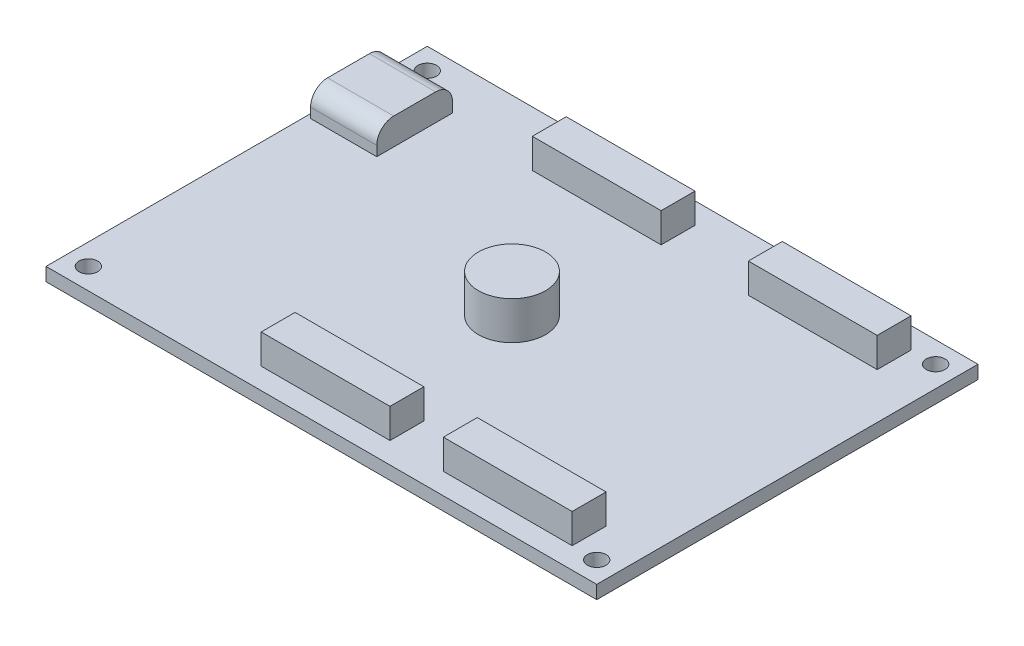
ISO-10303-21;
HEADER;
FILE_DESCRIPTION(('STEP AP214'),'2;1');
FILE_NAME('part.step','',(''),(''),'','','');
FILE_SCHEMA(('AUTOMOTIVE_DESIGN { 1 0 10303 214 1 1 1 1 }'));
ENDSEC;
DATA;
#1=APPLICATION_CONTEXT('core data for automotive mechanical design processes');
#2=APPLICATION_PROTOCOL_DEFINITION('international standard','automotive_design',2000,#1);
#3=PRODUCT_CONTEXT('',#1,'mechanical');
#4=PRODUCT('Part','Part','',(#3));
#5=PRODUCT_RELATED_PRODUCT_CATEGORY('part','',(#4));
#6=PRODUCT_DEFINITION_FORMATION('','',#4);
#7=PRODUCT_DEFINITION_CONTEXT('part definition',#1,'design');
#8=PRODUCT_DEFINITION('design','',#6,#7);
#9=PRODUCT_DEFINITION_SHAPE('','',#8);
#10=(LENGTH_UNIT() NAMED_UNIT(*) SI_UNIT(.MILLI.,.METRE.));
#11=(NAMED_UNIT(*) PLANE_ANGLE_UNIT() SI_UNIT($,.RADIAN.));
#12=(NAMED_UNIT(*) SI_UNIT($,.STERADIAN.) SOLID_ANGLE_UNIT());
#13=UNCERTAINTY_MEASURE_WITH_UNIT(LENGTH_MEASURE(1.E-05),#10,'distance_accuracy_value','');
#14=(GEOMETRIC_REPRESENTATION_CONTEXT(3) GLOBAL_UNCERTAINTY_ASSIGNED_CONTEXT((#13)) GLOBAL_UNIT_ASSIGNED_CONTEXT((#10,
#11,#12)) REPRESENTATION_CONTEXT('',''));
#15=CARTESIAN_POINT('',(0.,0.,0.));
#16=DIRECTION('',(0.,0.,1.));
#17=DIRECTION('',(1.,0.,0.));
#18=AXIS2_PLACEMENT_3D('',#15,#16,#17);
#19=CARTESIAN_POINT('',(0.,0.,0.));
#20=DIRECTION('',(0.,1.,0.));
#21=DIRECTION('',(0.,0.,1.));
#22=AXIS2_PLACEMENT_3D('',#19,#20,#21);
#23=PLANE('',#22);
#24=CARTESIAN_POINT('',(0.,0.,0.));
#25=DIRECTION('',(0.,1.,0.));
#26=DIRECTION('',(0.,0.,1.));
#27=AXIS2_PLACEMENT_3D('',#24,#25,#26);
#28=CIRCLE('',#27,3.96204769980138);
#29=CARTESIAN_POINT('',(0.,0.,3.96204769980138));
#30=VERTEX_POINT('',#29);
#31=EDGE_CURVE('E428',#30,#30,#28,.T.);
#32=ORIENTED_EDGE('',*,*,#31,.F.);
#33=EDGE_LOOP('',(#32));
#34=FACE_BOUND('',#33,.T.);
#35=DIRECTION('',(0.,0.,1.));
#36=VECTOR('',#35,1.);
#37=CARTESIAN_POINT('',(27.1,0.,0.));
#38=LINE('',#37,#36);
#39=CARTESIAN_POINT('',(27.1,0.,16.));
#40=VERTEX_POINT('',#39);
#41=CARTESIAN_POINT('',(27.1,0.,20.));
#42=VERTEX_POINT('',#41);
#43=EDGE_CURVE('E256',#40,#42,#38,.T.);
#44=ORIENTED_EDGE('',*,*,#43,.T.);
#45=DIRECTION('',(1.,0.,0.));
#46=VECTOR('',#45,1.);
#47=CARTESIAN_POINT('',(0.,0.,20.));
#48=LINE('',#47,#46);
#49=CARTESIAN_POINT('',(11.9,0.,20.));
#50=VERTEX_POINT('',#49);
#51=EDGE_CURVE('E261',#50,#42,#48,.T.);
#52=ORIENTED_EDGE('',*,*,#51,.F.);
#53=DIRECTION('',(0.,0.,1.));
#54=VECTOR('',#53,1.);
#55=CARTESIAN_POINT('',(11.9,0.,0.));
#56=LINE('',#55,#54);
#57=CARTESIAN_POINT('',(11.9,0.,16.));
#58=VERTEX_POINT('',#57);
#59=EDGE_CURVE('E274',#58,#50,#56,.T.);
#60=ORIENTED_EDGE('',*,*,#59,.F.);
#61=DIRECTION('',(1.,0.,0.));
#62=VECTOR('',#61,1.);
#63=CARTESIAN_POINT('',(0.,0.,16.));
#64=LINE('',#63,#62);
#65=EDGE_CURVE('E271',#58,#40,#64,.T.);
#66=ORIENTED_EDGE('',*,*,#65,.T.);
#67=EDGE_LOOP('',(#44,#52,#60,#66));
#68=FACE_BOUND('',#67,.T.);
#69=DIRECTION('',(0.,0.,1.));
#70=VECTOR('',#69,1.);
#71=CARTESIAN_POINT('',(27.1,0.,0.));
#72=LINE('',#71,#70);
#73=CARTESIAN_POINT('',(27.1,0.,-20.));
#74=VERTEX_POINT('',#73);
#75=CARTESIAN_POINT('',(27.1,0.,-16.));
#76=VERTEX_POINT('',#75);
#77=EDGE_CURVE('E286',#74,#76,#72,.T.);
#78=ORIENTED_EDGE('',*,*,#77,.T.);
#79=DIRECTION('',(1.,0.,0.));
#80=VECTOR('',#79,1.);
#81=CARTESIAN_POINT('',(0.,0.,-16.));
#82=LINE('',#81,#80);
#83=CARTESIAN_POINT('',(11.9,0.,-16.));
#84=VERTEX_POINT('',#83);
#85=EDGE_CURVE('E291',#84,#76,#82,.T.);
#86=ORIENTED_EDGE('',*,*,#85,.F.);
#87=DIRECTION('',(0.,0.,1.));
#88=VECTOR('',#87,1.);
#89=CARTESIAN_POINT('',(11.9,0.,0.));
#90=LINE('',#89,#88);
#91=CARTESIAN_POINT('',(11.9,0.,-20.));
#92=VERTEX_POINT('',#91);
#93=EDGE_CURVE('E304',#92,#84,#90,.T.);
#94=ORIENTED_EDGE('',*,*,#93,.F.);
#95=DIRECTION('',(1.,0.,0.));
#96=VECTOR('',#95,1.);
#97=CARTESIAN_POINT('',(0.,0.,-20.));
#98=LINE('',#97,#96);
#99=EDGE_CURVE('E301',#92,#74,#98,.T.);
#100=ORIENTED_EDGE('',*,*,#99,.T.);
#101=EDGE_LOOP('',(#78,#86,#94,#100));
#102=FACE_BOUND('',#101,.T.);
#103=DIRECTION('',(0.,0.,1.));
#104=VECTOR('',#103,1.);
#105=CARTESIAN_POINT('',(1.60000000000001,0.,0.));
#106=LINE('',#105,#104);
#107=CARTESIAN_POINT('',(1.60000000000001,0.,-20.));
#108=VERTEX_POINT('',#107);
#109=CARTESIAN_POINT('',(1.60000000000001,0.,-16.));
#110=VERTEX_POINT('',#109);
#111=EDGE_CURVE('E316',#108,#110,#106,.T.);
#112=ORIENTED_EDGE('',*,*,#111,.T.);
#113=DIRECTION('',(1.,0.,0.));
#114=VECTOR('',#113,1.);
#115=CARTESIAN_POINT('',(0.,0.,-16.));
#116=LINE('',#115,#114);
#117=CARTESIAN_POINT('',(-13.6,0.,-16.));
#118=VERTEX_POINT('',#117);
#119=EDGE_CURVE('E321',#118,#110,#116,.T.);
#120=ORIENTED_EDGE('',*,*,#119,.F.);
#121=DIRECTION('',(0.,0.,1.));
#122=VECTOR('',#121,1.);
#123=CARTESIAN_POINT('',(-13.6,0.,0.));
#124=LINE('',#123,#122);
#125=CARTESIAN_POINT('',(-13.6,0.,-20.));
#126=VERTEX_POINT('',#125);
#127=EDGE_CURVE('E334',#126,#118,#124,.T.);
#128=ORIENTED_EDGE('',*,*,#127,.F.);
#129=DIRECTION('',(1.,0.,0.));
#130=VECTOR('',#129,1.);
#131=CARTESIAN_POINT('',(0.,0.,-20.));
#132=LINE('',#131,#130);
#133=EDGE_CURVE('E331',#126,#108,#132,.T.);
#134=ORIENTED_EDGE('',*,*,#133,.T.);
#135=EDGE_LOOP('',(#112,#120,#128,#134));
#136=FACE_BOUND('',#135,.T.);
#137=DIRECTION('',(0.,0.,1.));
#138=VECTOR('',#137,1.);
#139=CARTESIAN_POINT('',(5.6,0.,0.));
#140=LINE('',#139,#138);
#141=CARTESIAN_POINT('',(5.60000000000001,0.,16.));
#142=VERTEX_POINT('',#141);
#143=CARTESIAN_POINT('',(5.60000000000002,0.,20.));
#144=VERTEX_POINT('',#143);
#145=EDGE_CURVE('E346',#142,#144,#140,.T.);
#146=ORIENTED_EDGE('',*,*,#145,.T.);
#147=DIRECTION('',(1.,0.,0.));
#148=VECTOR('',#147,1.);
#149=CARTESIAN_POINT('',(0.,0.,20.));
#150=LINE('',#149,#148);
#151=CARTESIAN_POINT('',(-9.59999999999998,0.,20.0000000000001));
#152=VERTEX_POINT('',#151);
#153=EDGE_CURVE('E351',#152,#144,#150,.T.);
#154=ORIENTED_EDGE('',*,*,#153,.F.);
#155=DIRECTION('',(0.,0.,1.));
#156=VECTOR('',#155,1.);
#157=CARTESIAN_POINT('',(-9.6,0.,0.));
#158=LINE('',#157,#156);
#159=CARTESIAN_POINT('',(-9.59999999999998,0.,16.));
#160=VERTEX_POINT('',#159);
#161=EDGE_CURVE('E365',#160,#152,#158,.T.);
#162=ORIENTED_EDGE('',*,*,#161,.F.);
#163=DIRECTION('',(1.,0.,0.));
#164=VECTOR('',#163,1.);
#165=CARTESIAN_POINT('',(0.,0.,16.));
#166=LINE('',#165,#164);
#167=EDGE_CURVE('E362',#160,#142,#166,.T.);
#168=ORIENTED_EDGE('',*,*,#167,.T.);
#169=EDGE_LOOP('',(#146,#154,#162,#168));
#170=FACE_BOUND('',#169,.T.);
#171=CARTESIAN_POINT('',(30.,0.,20.));
#172=DIRECTION('',(0.,1.,0.));
#173=DIRECTION('',(0.,0.,1.));
#174=AXIS2_PLACEMENT_3D('',#171,#172,#173);
#175=CIRCLE('',#174,1.1);
#176=CARTESIAN_POINT('',(30.,0.,21.1));
#177=VERTEX_POINT('',#176);
#178=EDGE_CURVE('E378',#177,#177,#175,.T.);
#179=ORIENTED_EDGE('',*,*,#178,.F.);
#180=EDGE_LOOP('',(#179));
#181=FACE_BOUND('',#180,.T.);
#182=CARTESIAN_POINT('',(30.,0.,-20.));
#183=DIRECTION('',(0.,1.,0.));
#184=DIRECTION('',(0.,0.,1.));
#185=AXIS2_PLACEMENT_3D('',#182,#183,#184);
#186=CIRCLE('',#185,1.1);
#187=CARTESIAN_POINT('',(30.,0.,-18.9));
#188=VERTEX_POINT('',#187);
#189=EDGE_CURVE('E406',#188,#188,#186,.T.);
#190=ORIENTED_EDGE('',*,*,#189,.F.);
#191=EDGE_LOOP('',(#190));
#192=FACE_BOUND('',#191,.T.);
#193=CARTESIAN_POINT('',(-30.,0.,-20.));
#194=DIRECTION('',(0.,1.,0.));
#195=DIRECTION('',(0.,0.,1.));
#196=AXIS2_PLACEMENT_3D('',#193,#194,#195);
#197=CIRCLE('',#196,1.1);
#198=CARTESIAN_POINT('',(-30.,0.,-18.9));
#199=VERTEX_POINT('',#198);
#200=EDGE_CURVE('E409',#199,#199,#197,.T.);
#201=ORIENTED_EDGE('',*,*,#200,.F.);
#202=EDGE_LOOP('',(#201));
#203=FACE_BOUND('',#202,.T.);
#204=CARTESIAN_POINT('',(-30.,0.,20.));
#205=DIRECTION('',(0.,1.,0.));
#206=DIRECTION('',(0.,0.,1.));
#207=AXIS2_PLACEMENT_3D('',#204,#205,#206);
#208=CIRCLE('',#207,1.1);
#209=CARTESIAN_POINT('',(-30.,0.,21.1));
#210=VERTEX_POINT('',#209);
#211=EDGE_CURVE('E412',#210,#210,#208,.T.);
#212=ORIENTED_EDGE('',*,*,#211,.F.);
#213=EDGE_LOOP('',(#212));
#214=FACE_BOUND('',#213,.T.);
#215=DIRECTION('',(0.,0.,-1.));
#216=VECTOR('',#215,1.);
#217=CARTESIAN_POINT('',(-32.5,0.,0.));
#218=LINE('',#217,#216);
#219=CARTESIAN_POINT('',(-32.5,0.,22.5));
#220=VERTEX_POINT('',#219);
#221=CARTESIAN_POINT('',(-32.5,0.,-22.5));
#222=VERTEX_POINT('',#221);
#223=EDGE_CURVE('E415',#220,#222,#218,.T.);
#224=ORIENTED_EDGE('',*,*,#223,.F.);
#225=DIRECTION('',(-1.,0.,0.));
#226=VECTOR('',#225,1.);
#227=CARTESIAN_POINT('',(0.,0.,22.5));
#228=LINE('',#227,#226);
#229=CARTESIAN_POINT('',(32.5,0.,22.5));
#230=VERTEX_POINT('',#229);
#231=EDGE_CURVE('E418',#230,#220,#228,.T.);
#232=ORIENTED_EDGE('',*,*,#231,.F.);
#233=DIRECTION('',(0.,0.,-1.));
#234=VECTOR('',#233,1.);
#235=CARTESIAN_POINT('',(32.5,0.,0.));
#236=LINE('',#235,#234);
#237=CARTESIAN_POINT('',(32.5,0.,-22.5));
#238=VERTEX_POINT('',#237);
#239=EDGE_CURVE('E421',#230,#238,#236,.T.);
#240=ORIENTED_EDGE('',*,*,#239,.T.);
#241=DIRECTION('',(-1.,0.,0.));
#242=VECTOR('',#241,1.);
#243=CARTESIAN_POINT('',(0.,0.,-22.5));
#244=LINE('',#243,#242);
#245=EDGE_CURVE('E383',#238,#222,#244,.T.);
#246=ORIENTED_EDGE('',*,*,#245,.T.);
#247=EDGE_LOOP('',(#224,#232,#240,#246));
#248=FACE_BOUND('',#247,.T.);
#249=DIRECTION('',(1.,0.,0.));
#250=VECTOR('',#249,1.);
#251=CARTESIAN_POINT('',(-32.,0.,-8.23000129));
#252=LINE('',#251,#250);
#253=CARTESIAN_POINT('',(-32.,0.,-8.23000129));
#254=VERTEX_POINT('',#253);
#255=CARTESIAN_POINT('',(-24.19,0.,-8.23000129));
#256=VERTEX_POINT('',#255);
#257=EDGE_CURVE('E217',#254,#256,#252,.T.);
#258=ORIENTED_EDGE('',*,*,#257,.F.);
#259=DIRECTION('',(0.,0.,1.));
#260=VECTOR('',#259,1.);
#261=CARTESIAN_POINT('',(-32.,0.,-17.17000129));
#262=LINE('',#261,#260);
#263=CARTESIAN_POINT('',(-32.,0.,-17.17000129));
#264=VERTEX_POINT('',#263);
#265=EDGE_CURVE('E226',#264,#254,#262,.T.);
#266=ORIENTED_EDGE('',*,*,#265,.F.);
#267=DIRECTION('',(-1.,0.,0.));
#268=VECTOR('',#267,1.);
#269=CARTESIAN_POINT('',(-32.,0.,-17.17000129));
#270=LINE('',#269,#268);
#271=CARTESIAN_POINT('',(-24.19,0.,-17.17000129));
#272=VERTEX_POINT('',#271);
#273=EDGE_CURVE('E237',#272,#264,#270,.T.);
#274=ORIENTED_EDGE('',*,*,#273,.F.);
#275=DIRECTION('',(0.,0.,-1.));
#276=VECTOR('',#275,1.);
#277=CARTESIAN_POINT('',(-24.19,0.,-17.17000129));
#278=LINE('',#277,#276);
#279=EDGE_CURVE('E235',#256,#272,#278,.T.);
#280=ORIENTED_EDGE('',*,*,#279,.F.);
#281=EDGE_LOOP('',(#258,#266,#274,#280));
#282=FACE_BOUND('',#281,.T.);
#283=ADVANCED_FACE('F40',(#34,#68,#102,#136,#170,#181,#192,#203,#214,#248,#282),#23,.T.);
#284=CARTESIAN_POINT('',(-32.5,-1.57,0.));
#285=DIRECTION('',(1.,0.,0.));
#286=DIRECTION('',(0.,0.,-1.));
#287=AXIS2_PLACEMENT_3D('',#284,#285,#286);
#288=PLANE('',#287);
#289=ORIENTED_EDGE('',*,*,#223,.T.);
#290=DIRECTION('',(0.,1.,0.));
#291=VECTOR('',#290,1.);
#292=CARTESIAN_POINT('',(-32.5,-1.57,-22.5));
#293=LINE('',#292,#291);
#294=CARTESIAN_POINT('',(-32.5,-1.57,-22.5));
#295=VERTEX_POINT('',#294);
#296=EDGE_CURVE('E426',#295,#222,#293,.T.);
#297=ORIENTED_EDGE('',*,*,#296,.F.);
#298=DIRECTION('',(0.,0.,-1.));
#299=VECTOR('',#298,1.);
#300=CARTESIAN_POINT('',(-32.5,-1.57,0.));
#301=LINE('',#300,#299);
#302=CARTESIAN_POINT('',(-32.5,-1.57,22.5));
#303=VERTEX_POINT('',#302);
#304=EDGE_CURVE('E392',#303,#295,#301,.T.);
#305=ORIENTED_EDGE('',*,*,#304,.F.);
#306=DIRECTION('',(0.,1.,0.));
#307=VECTOR('',#306,1.);
#308=CARTESIAN_POINT('',(-32.5,-1.57,22.5));
#309=LINE('',#308,#307);
#310=EDGE_CURVE('E403',#303,#220,#309,.T.);
#311=ORIENTED_EDGE('',*,*,#310,.T.);
#312=EDGE_LOOP('',(#289,#297,#305,#311));
#313=FACE_BOUND('',#312,.T.);
#314=ADVANCED_FACE('F466',(#313),#288,.F.);
#315=CARTESIAN_POINT('',(0.,-1.57,-22.5));
#316=DIRECTION('',(0.,0.,-1.));
#317=DIRECTION('',(-1.,0.,0.));
#318=AXIS2_PLACEMENT_3D('',#315,#316,#317);
#319=PLANE('',#318);
#320=ORIENTED_EDGE('',*,*,#245,.F.);
#321=DIRECTION('',(0.,1.,0.));
#322=VECTOR('',#321,1.);
#323=CARTESIAN_POINT('',(32.5,-1.57,-22.5));
#324=LINE('',#323,#322);
#325=CARTESIAN_POINT('',(32.5,-1.57,-22.5));
#326=VERTEX_POINT('',#325);
#327=EDGE_CURVE('E429',#326,#238,#324,.T.);
#328=ORIENTED_EDGE('',*,*,#327,.F.);
#329=DIRECTION('',(-1.,0.,0.));
#330=VECTOR('',#329,1.);
#331=CARTESIAN_POINT('',(0.,-1.57,-22.5));
#332=LINE('',#331,#330);
#333=EDGE_CURVE('E400',#326,#295,#332,.T.);
#334=ORIENTED_EDGE('',*,*,#333,.T.);
#335=ORIENTED_EDGE('',*,*,#296,.T.);
#336=EDGE_LOOP('',(#320,#328,#334,#335));
#337=FACE_BOUND('',#336,.T.);
#338=ADVANCED_FACE('F472',(#337),#319,.T.);
#339=CARTESIAN_POINT('',(32.5,-1.57,0.));
#340=DIRECTION('',(1.,0.,0.));
#341=DIRECTION('',(0.,0.,-1.));
#342=AXIS2_PLACEMENT_3D('',#339,#340,#341);
#343=PLANE('',#342);
#344=ORIENTED_EDGE('',*,*,#239,.F.);
#345=DIRECTION('',(0.,1.,0.));
#346=VECTOR('',#345,1.);
#347=CARTESIAN_POINT('',(32.5,-1.57,22.5));
#348=LINE('',#347,#346);
#349=CARTESIAN_POINT('',(32.5,-1.57,22.5));
#350=VERTEX_POINT('',#349);
#351=EDGE_CURVE('E431',#350,#230,#348,.T.);
#352=ORIENTED_EDGE('',*,*,#351,.F.);
#353=DIRECTION('',(0.,0.,-1.));
#354=VECTOR('',#353,1.);
#355=CARTESIAN_POINT('',(32.5,-1.57,0.));
#356=LINE('',#355,#354);
#357=EDGE_CURVE('E397',#350,#326,#356,.T.);
#358=ORIENTED_EDGE('',*,*,#357,.T.);
#359=ORIENTED_EDGE('',*,*,#327,.T.);
#360=EDGE_LOOP('',(#344,#352,#358,#359));
#361=FACE_BOUND('',#360,.T.);
#362=ADVANCED_FACE('F483',(#361),#343,.T.);
#363=CARTESIAN_POINT('',(-30.,-1.57,20.));
#364=DIRECTION('',(0.,1.,0.));
#365=DIRECTION('',(0.,0.,1.));
#366=AXIS2_PLACEMENT_3D('',#363,#364,#365);
#367=CYLINDRICAL_SURFACE('',#366,1.1);
#368=CARTESIAN_POINT('',(-30.,-1.57,20.));
#369=DIRECTION('',(0.,1.,0.));
#370=DIRECTION('',(0.,0.,1.));
#371=AXIS2_PLACEMENT_3D('',#368,#369,#370);
#372=CIRCLE('',#371,1.1);
#373=CARTESIAN_POINT('',(-30.,-1.57,21.1));
#374=VERTEX_POINT('',#373);
#375=EDGE_CURVE('E389',#374,#374,#372,.T.);
#376=ORIENTED_EDGE('',*,*,#375,.F.);
#377=EDGE_LOOP('',(#376));
#378=FACE_BOUND('',#377,.T.);
#379=ORIENTED_EDGE('',*,*,#211,.T.);
#380=EDGE_LOOP('',(#379));
#381=FACE_BOUND('',#380,.T.);
#382=ADVANCED_FACE('F487',(#378,#381),#367,.F.);
#383=CARTESIAN_POINT('',(-30.,-1.57,-20.));
#384=DIRECTION('',(0.,1.,0.));
#385=DIRECTION('',(0.,0.,1.));
#386=AXIS2_PLACEMENT_3D('',#383,#384,#385);
#387=CYLINDRICAL_SURFACE('',#386,1.1);
#388=CARTESIAN_POINT('',(-30.,-1.57,-20.));
#389=DIRECTION('',(0.,1.,0.));
#390=DIRECTION('',(0.,0.,1.));
#391=AXIS2_PLACEMENT_3D('',#388,#389,#390);
#392=CIRCLE('',#391,1.1);
#393=CARTESIAN_POINT('',(-30.,-1.57,-18.9));
#394=VERTEX_POINT('',#393);
#395=EDGE_CURVE('E386',#394,#394,#392,.T.);
#396=ORIENTED_EDGE('',*,*,#395,.F.);
#397=EDGE_LOOP('',(#396));
#398=FACE_BOUND('',#397,.T.);
#399=ORIENTED_EDGE('',*,*,#200,.T.);
#400=EDGE_LOOP('',(#399));
#401=FACE_BOUND('',#400,.T.);
#402=ADVANCED_FACE('F496',(#398,#401),#387,.F.);
#403=CARTESIAN_POINT('',(30.,-1.57,-20.));
#404=DIRECTION('',(0.,1.,0.));
#405=DIRECTION('',(0.,0.,1.));
#406=AXIS2_PLACEMENT_3D('',#403,#404,#405);
#407=CYLINDRICAL_SURFACE('',#406,1.1);
#408=CARTESIAN_POINT('',(30.,-1.57,-20.));
#409=DIRECTION('',(0.,1.,0.));
#410=DIRECTION('',(0.,0.,1.));
#411=AXIS2_PLACEMENT_3D('',#408,#409,#410);
#412=CIRCLE('',#411,1.1);
#413=CARTESIAN_POINT('',(30.,-1.57,-18.9));
#414=VERTEX_POINT('',#413);
#415=EDGE_CURVE('E382',#414,#414,#412,.T.);
#416=ORIENTED_EDGE('',*,*,#415,.F.);
#417=EDGE_LOOP('',(#416));
#418=FACE_BOUND('',#417,.T.);
#419=ORIENTED_EDGE('',*,*,#189,.T.);
#420=EDGE_LOOP('',(#419));
#421=FACE_BOUND('',#420,.T.);
#422=ADVANCED_FACE('F500',(#418,#421),#407,.F.);
#423=CARTESIAN_POINT('',(30.,-1.57,20.));
#424=DIRECTION('',(0.,1.,0.));
#425=DIRECTION('',(0.,0.,1.));
#426=AXIS2_PLACEMENT_3D('',#423,#424,#425);
#427=CYLINDRICAL_SURFACE('',#426,1.1);
#428=CARTESIAN_POINT('',(30.,-1.57,20.));
#429=DIRECTION('',(0.,1.,0.));
#430=DIRECTION('',(0.,0.,1.));
#431=AXIS2_PLACEMENT_3D('',#428,#429,#430);
#432=CIRCLE('',#431,1.1);
#433=CARTESIAN_POINT('',(30.,-1.57,21.1));
#434=VERTEX_POINT('',#433);
#435=EDGE_CURVE('E379',#434,#434,#432,.T.);
#436=ORIENTED_EDGE('',*,*,#435,.F.);
#437=EDGE_LOOP('',(#436));
#438=FACE_BOUND('',#437,.T.);
#439=ORIENTED_EDGE('',*,*,#178,.T.);
#440=EDGE_LOOP('',(#439));
#441=FACE_BOUND('',#440,.T.);
#442=ADVANCED_FACE('F491',(#438,#441),#427,.F.);
#443=CARTESIAN_POINT('',(0.,-1.57,22.5));
#444=DIRECTION('',(0.,0.,-1.));
#445=DIRECTION('',(-1.,0.,0.));
#446=AXIS2_PLACEMENT_3D('',#443,#444,#445);
#447=PLANE('',#446);
#448=ORIENTED_EDGE('',*,*,#231,.T.);
#449=ORIENTED_EDGE('',*,*,#310,.F.);
#450=DIRECTION('',(-1.,0.,0.));
#451=VECTOR('',#450,1.);
#452=CARTESIAN_POINT('',(0.,-1.57,22.5));
#453=LINE('',#452,#451);
#454=EDGE_CURVE('E394',#350,#303,#453,.T.);
#455=ORIENTED_EDGE('',*,*,#454,.F.);
#456=ORIENTED_EDGE('',*,*,#351,.T.);
#457=EDGE_LOOP('',(#448,#449,#455,#456));
#458=FACE_BOUND('',#457,.T.);
#459=ADVANCED_FACE('F489',(#458),#447,.F.);
#460=CARTESIAN_POINT('',(0.,-1.57,0.));
#461=DIRECTION('',(0.,1.,0.));
#462=DIRECTION('',(0.,0.,1.));
#463=AXIS2_PLACEMENT_3D('',#460,#461,#462);
#464=PLANE('',#463);
#465=CARTESIAN_POINT('',(0.,-1.57,0.));
#466=DIRECTION('',(0.,1.,0.));
#467=DIRECTION('',(0.,0.,1.));
#468=AXIS2_PLACEMENT_3D('',#465,#466,#467);
#469=CIRCLE('',#468,3.96204769980138);
#470=CARTESIAN_POINT('',(0.,-1.57,3.96204769980138));
#471=VERTEX_POINT('',#470);
#472=EDGE_CURVE('E253',#471,#471,#469,.T.);
#473=ORIENTED_EDGE('',*,*,#472,.T.);
#474=EDGE_LOOP('',(#473));
#475=FACE_BOUND('',#474,.T.);
#476=ORIENTED_EDGE('',*,*,#435,.T.);
#477=EDGE_LOOP('',(#476));
#478=FACE_BOUND('',#477,.T.);
#479=ORIENTED_EDGE('',*,*,#415,.T.);
#480=EDGE_LOOP('',(#479));
#481=FACE_BOUND('',#480,.T.);
#482=ORIENTED_EDGE('',*,*,#395,.T.);
#483=EDGE_LOOP('',(#482));
#484=FACE_BOUND('',#483,.T.);
#485=ORIENTED_EDGE('',*,*,#375,.T.);
#486=EDGE_LOOP('',(#485));
#487=FACE_BOUND('',#486,.T.);
#488=ORIENTED_EDGE('',*,*,#304,.T.);
#489=ORIENTED_EDGE('',*,*,#333,.F.);
#490=ORIENTED_EDGE('',*,*,#357,.F.);
#491=ORIENTED_EDGE('',*,*,#454,.T.);
#492=EDGE_LOOP('',(#488,#489,#490,#491));
#493=FACE_BOUND('',#492,.T.);
#494=ADVANCED_FACE('F479',(#475,#478,#481,#484,#487,#493),#464,.F.);
#495=CARTESIAN_POINT('',(5.6,3.5,0.));
#496=DIRECTION('',(1.,0.,0.));
#497=DIRECTION('',(0.,0.,-1.));
#498=AXIS2_PLACEMENT_3D('',#495,#496,#497);
#499=PLANE('',#498);
#500=ORIENTED_EDGE('',*,*,#145,.F.);
#501=DIRECTION('',(0.,-1.,0.));
#502=VECTOR('',#501,1.);
#503=CARTESIAN_POINT('',(5.60000000000001,3.5,16.));
#504=LINE('',#503,#502);
#505=CARTESIAN_POINT('',(5.60000000000001,3.5,16.));
#506=VERTEX_POINT('',#505);
#507=EDGE_CURVE('E376',#506,#142,#504,.T.);
#508=ORIENTED_EDGE('',*,*,#507,.F.);
#509=DIRECTION('',(0.,0.,1.));
#510=VECTOR('',#509,1.);
#511=CARTESIAN_POINT('',(5.6,3.5,0.));
#512=LINE('',#511,#510);
#513=CARTESIAN_POINT('',(5.60000000000002,3.5,20.));
#514=VERTEX_POINT('',#513);
#515=EDGE_CURVE('E347',#506,#514,#512,.T.);
#516=ORIENTED_EDGE('',*,*,#515,.T.);
#517=DIRECTION('',(0.,-1.,0.));
#518=VECTOR('',#517,1.);
#519=CARTESIAN_POINT('',(5.60000000000002,3.5,20.));
#520=LINE('',#519,#518);
#521=EDGE_CURVE('E359',#514,#144,#520,.T.);
#522=ORIENTED_EDGE('',*,*,#521,.T.);
#523=EDGE_LOOP('',(#500,#508,#516,#522));
#524=FACE_BOUND('',#523,.T.);
#525=ADVANCED_FACE('F532',(#524),#499,.T.);
#526=CARTESIAN_POINT('',(0.,3.5,16.));
#527=DIRECTION('',(0.,0.,-1.));
#528=DIRECTION('',(-1.,0.,0.));
#529=AXIS2_PLACEMENT_3D('',#526,#527,#528);
#530=PLANE('',#529);
#531=ORIENTED_EDGE('',*,*,#167,.F.);
#532=DIRECTION('',(0.,-1.,0.));
#533=VECTOR('',#532,1.);
#534=CARTESIAN_POINT('',(-9.59999999999998,3.5,16.));
#535=LINE('',#534,#533);
#536=CARTESIAN_POINT('',(-9.59999999999998,3.5,16.));
#537=VERTEX_POINT('',#536);
#538=EDGE_CURVE('E374',#537,#160,#535,.T.);
#539=ORIENTED_EDGE('',*,*,#538,.F.);
#540=DIRECTION('',(1.,0.,0.));
#541=VECTOR('',#540,1.);
#542=CARTESIAN_POINT('',(0.,3.5,16.));
#543=LINE('',#542,#541);
#544=EDGE_CURVE('E350',#537,#506,#543,.T.);
#545=ORIENTED_EDGE('',*,*,#544,.T.);
#546=ORIENTED_EDGE('',*,*,#507,.T.);
#547=EDGE_LOOP('',(#531,#539,#545,#546));
#548=FACE_BOUND('',#547,.T.);
#549=ADVANCED_FACE('F537',(#548),#530,.T.);
#550=CARTESIAN_POINT('',(-9.6,3.5,0.));
#551=DIRECTION('',(1.,0.,0.));
#552=DIRECTION('',(0.,0.,-1.));
#553=AXIS2_PLACEMENT_3D('',#550,#551,#552);
#554=PLANE('',#553);
#555=ORIENTED_EDGE('',*,*,#161,.T.);
#556=DIRECTION('',(0.,-1.,0.));
#557=VECTOR('',#556,1.);
#558=CARTESIAN_POINT('',(-9.59999999999998,3.5,20.0000000000001));
#559=LINE('',#558,#557);
#560=CARTESIAN_POINT('',(-9.59999999999998,3.5,20.0000000000001));
#561=VERTEX_POINT('',#560);
#562=EDGE_CURVE('E372',#561,#152,#559,.T.);
#563=ORIENTED_EDGE('',*,*,#562,.F.);
#564=DIRECTION('',(0.,0.,1.));
#565=VECTOR('',#564,1.);
#566=CARTESIAN_POINT('',(-9.6,3.5,0.));
#567=LINE('',#566,#565);
#568=EDGE_CURVE('E354',#537,#561,#567,.T.);
#569=ORIENTED_EDGE('',*,*,#568,.F.);
#570=ORIENTED_EDGE('',*,*,#538,.T.);
#571=EDGE_LOOP('',(#555,#563,#569,#570));
#572=FACE_BOUND('',#571,.T.);
#573=ADVANCED_FACE('F634',(#572),#554,.F.);
#574=CARTESIAN_POINT('',(0.,3.5,20.));
#575=DIRECTION('',(0.,0.,-1.));
#576=DIRECTION('',(-1.,0.,0.));
#577=AXIS2_PLACEMENT_3D('',#574,#575,#576);
#578=PLANE('',#577);
#579=ORIENTED_EDGE('',*,*,#153,.T.);
#580=ORIENTED_EDGE('',*,*,#521,.F.);
#581=DIRECTION('',(1.,0.,0.));
#582=VECTOR('',#581,1.);
#583=CARTESIAN_POINT('',(0.,3.5,20.));
#584=LINE('',#583,#582);
#585=EDGE_CURVE('E356',#561,#514,#584,.T.);
#586=ORIENTED_EDGE('',*,*,#585,.F.);
#587=ORIENTED_EDGE('',*,*,#562,.T.);
#588=EDGE_LOOP('',(#579,#580,#586,#587));
#589=FACE_BOUND('',#588,.T.);
#590=ADVANCED_FACE('F630',(#589),#578,.F.);
#591=CARTESIAN_POINT('',(0.,3.5,0.));
#592=DIRECTION('',(0.,1.,0.));
#593=DIRECTION('',(0.,0.,1.));
#594=AXIS2_PLACEMENT_3D('',#591,#592,#593);
#595=PLANE('',#594);
#596=ORIENTED_EDGE('',*,*,#515,.F.);
#597=ORIENTED_EDGE('',*,*,#544,.F.);
#598=ORIENTED_EDGE('',*,*,#568,.T.);
#599=ORIENTED_EDGE('',*,*,#585,.T.);
#600=EDGE_LOOP('',(#596,#597,#598,#599));
#601=FACE_BOUND('',#600,.T.);
#602=ADVANCED_FACE('F626',(#601),#595,.T.);
#603=CARTESIAN_POINT('',(1.60000000000001,3.5,0.));
#604=DIRECTION('',(1.,0.,0.));
#605=DIRECTION('',(0.,0.,-1.));
#606=AXIS2_PLACEMENT_3D('',#603,#604,#605);
#607=PLANE('',#606);
#608=ORIENTED_EDGE('',*,*,#111,.F.);
#609=DIRECTION('',(0.,-1.,0.));
#610=VECTOR('',#609,1.);
#611=CARTESIAN_POINT('',(1.60000000000001,3.5,-20.));
#612=LINE('',#611,#610);
#613=CARTESIAN_POINT('',(1.60000000000001,3.5,-20.));
#614=VERTEX_POINT('',#613);
#615=EDGE_CURVE('E344',#614,#108,#612,.T.);
#616=ORIENTED_EDGE('',*,*,#615,.F.);
#617=DIRECTION('',(0.,0.,1.));
#618=VECTOR('',#617,1.);
#619=CARTESIAN_POINT('',(1.60000000000001,3.5,0.));
#620=LINE('',#619,#618);
#621=CARTESIAN_POINT('',(1.60000000000001,3.5,-16.));
#622=VERTEX_POINT('',#621);
#623=EDGE_CURVE('E317',#614,#622,#620,.T.);
#624=ORIENTED_EDGE('',*,*,#623,.T.);
#625=DIRECTION('',(0.,-1.,0.));
#626=VECTOR('',#625,1.);
#627=CARTESIAN_POINT('',(1.60000000000001,3.5,-16.));
#628=LINE('',#627,#626);
#629=EDGE_CURVE('E328',#622,#110,#628,.T.);
#630=ORIENTED_EDGE('',*,*,#629,.T.);
#631=EDGE_LOOP('',(#608,#616,#624,#630));
#632=FACE_BOUND('',#631,.T.);
#633=ADVANCED_FACE('F622',(#632),#607,.T.);
#634=CARTESIAN_POINT('',(0.,3.5,-20.));
#635=DIRECTION('',(0.,0.,-1.));
#636=DIRECTION('',(-1.,0.,0.));
#637=AXIS2_PLACEMENT_3D('',#634,#635,#636);
#638=PLANE('',#637);
#639=ORIENTED_EDGE('',*,*,#133,.F.);
#640=DIRECTION('',(0.,-1.,0.));
#641=VECTOR('',#640,1.);
#642=CARTESIAN_POINT('',(-13.6,3.5,-20.));
#643=LINE('',#642,#641);
#644=CARTESIAN_POINT('',(-13.6,3.5,-20.));
#645=VERTEX_POINT('',#644);
#646=EDGE_CURVE('E342',#645,#126,#643,.T.);
#647=ORIENTED_EDGE('',*,*,#646,.F.);
#648=DIRECTION('',(1.,0.,0.));
#649=VECTOR('',#648,1.);
#650=CARTESIAN_POINT('',(0.,3.5,-20.));
#651=LINE('',#650,#649);
#652=EDGE_CURVE('E320',#645,#614,#651,.T.);
#653=ORIENTED_EDGE('',*,*,#652,.T.);
#654=ORIENTED_EDGE('',*,*,#615,.T.);
#655=EDGE_LOOP('',(#639,#647,#653,#654));
#656=FACE_BOUND('',#655,.T.);
#657=ADVANCED_FACE('F618',(#656),#638,.T.);
#658=CARTESIAN_POINT('',(-13.6,3.5,0.));
#659=DIRECTION('',(1.,0.,0.));
#660=DIRECTION('',(0.,0.,-1.));
#661=AXIS2_PLACEMENT_3D('',#658,#659,#660);
#662=PLANE('',#661);
#663=ORIENTED_EDGE('',*,*,#127,.T.);
#664=DIRECTION('',(0.,-1.,0.));
#665=VECTOR('',#664,1.);
#666=CARTESIAN_POINT('',(-13.6,3.5,-16.));
#667=LINE('',#666,#665);
#668=CARTESIAN_POINT('',(-13.6,3.5,-16.));
#669=VERTEX_POINT('',#668);
#670=EDGE_CURVE('E340',#669,#118,#667,.T.);
#671=ORIENTED_EDGE('',*,*,#670,.F.);
#672=DIRECTION('',(0.,0.,1.));
#673=VECTOR('',#672,1.);
#674=CARTESIAN_POINT('',(-13.6,3.5,0.));
#675=LINE('',#674,#673);
#676=EDGE_CURVE('E324',#645,#669,#675,.T.);
#677=ORIENTED_EDGE('',*,*,#676,.F.);
#678=ORIENTED_EDGE('',*,*,#646,.T.);
#679=EDGE_LOOP('',(#663,#671,#677,#678));
#680=FACE_BOUND('',#679,.T.);
#681=ADVANCED_FACE('F614',(#680),#662,.F.);
#682=CARTESIAN_POINT('',(0.,3.5,-16.));
#683=DIRECTION('',(0.,0.,-1.));
#684=DIRECTION('',(-1.,0.,0.));
#685=AXIS2_PLACEMENT_3D('',#682,#683,#684);
#686=PLANE('',#685);
#687=ORIENTED_EDGE('',*,*,#119,.T.);
#688=ORIENTED_EDGE('',*,*,#629,.F.);
#689=DIRECTION('',(1.,0.,0.));
#690=VECTOR('',#689,1.);
#691=CARTESIAN_POINT('',(0.,3.5,-16.));
#692=LINE('',#691,#690);
#693=EDGE_CURVE('E326',#669,#622,#692,.T.);
#694=ORIENTED_EDGE('',*,*,#693,.F.);
#695=ORIENTED_EDGE('',*,*,#670,.T.);
#696=EDGE_LOOP('',(#687,#688,#694,#695));
#697=FACE_BOUND('',#696,.T.);
#698=ADVANCED_FACE('F610',(#697),#686,.F.);
#699=CARTESIAN_POINT('',(0.,3.5,0.));
#700=DIRECTION('',(0.,1.,0.));
#701=DIRECTION('',(0.,0.,1.));
#702=AXIS2_PLACEMENT_3D('',#699,#700,#701);
#703=PLANE('',#702);
#704=ORIENTED_EDGE('',*,*,#623,.F.);
#705=ORIENTED_EDGE('',*,*,#652,.F.);
#706=ORIENTED_EDGE('',*,*,#676,.T.);
#707=ORIENTED_EDGE('',*,*,#693,.T.);
#708=EDGE_LOOP('',(#704,#705,#706,#707));
#709=FACE_BOUND('',#708,.T.);
#710=ADVANCED_FACE('F606',(#709),#703,.T.);
#711=CARTESIAN_POINT('',(27.1,3.5,0.));
#712=DIRECTION('',(1.,0.,0.));
#713=DIRECTION('',(0.,0.,-1.));
#714=AXIS2_PLACEMENT_3D('',#711,#712,#713);
#715=PLANE('',#714);
#716=ORIENTED_EDGE('',*,*,#77,.F.);
#717=DIRECTION('',(0.,-1.,0.));
#718=VECTOR('',#717,1.);
#719=CARTESIAN_POINT('',(27.1,3.5,-20.));
#720=LINE('',#719,#718);
#721=CARTESIAN_POINT('',(27.1,3.5,-20.));
#722=VERTEX_POINT('',#721);
#723=EDGE_CURVE('E314',#722,#74,#720,.T.);
#724=ORIENTED_EDGE('',*,*,#723,.F.);
#725=DIRECTION('',(0.,0.,1.));
#726=VECTOR('',#725,1.);
#727=CARTESIAN_POINT('',(27.1,3.5,0.));
#728=LINE('',#727,#726);
#729=CARTESIAN_POINT('',(27.1,3.5,-16.));
#730=VERTEX_POINT('',#729);
#731=EDGE_CURVE('E287',#722,#730,#728,.T.);
#732=ORIENTED_EDGE('',*,*,#731,.T.);
#733=DIRECTION('',(0.,-1.,0.));
#734=VECTOR('',#733,1.);
#735=CARTESIAN_POINT('',(27.1,3.5,-16.));
#736=LINE('',#735,#734);
#737=EDGE_CURVE('E298',#730,#76,#736,.T.);
#738=ORIENTED_EDGE('',*,*,#737,.T.);
#739=EDGE_LOOP('',(#716,#724,#732,#738));
#740=FACE_BOUND('',#739,.T.);
#741=ADVANCED_FACE('F602',(#740),#715,.T.);
#742=CARTESIAN_POINT('',(0.,3.5,-20.));
#743=DIRECTION('',(0.,0.,-1.));
#744=DIRECTION('',(-1.,0.,0.));
#745=AXIS2_PLACEMENT_3D('',#742,#743,#744);
#746=PLANE('',#745);
#747=ORIENTED_EDGE('',*,*,#99,.F.);
#748=DIRECTION('',(0.,-1.,0.));
#749=VECTOR('',#748,1.);
#750=CARTESIAN_POINT('',(11.9,3.5,-20.));
#751=LINE('',#750,#749);
#752=CARTESIAN_POINT('',(11.9,3.5,-20.));
#753=VERTEX_POINT('',#752);
#754=EDGE_CURVE('E312',#753,#92,#751,.T.);
#755=ORIENTED_EDGE('',*,*,#754,.F.);
#756=DIRECTION('',(1.,0.,0.));
#757=VECTOR('',#756,1.);
#758=CARTESIAN_POINT('',(0.,3.5,-20.));
#759=LINE('',#758,#757);
#760=EDGE_CURVE('E290',#753,#722,#759,.T.);
#761=ORIENTED_EDGE('',*,*,#760,.T.);
#762=ORIENTED_EDGE('',*,*,#723,.T.);
#763=EDGE_LOOP('',(#747,#755,#761,#762));
#764=FACE_BOUND('',#763,.T.);
#765=ADVANCED_FACE('F598',(#764),#746,.T.);
#766=CARTESIAN_POINT('',(11.9,3.5,0.));
#767=DIRECTION('',(1.,0.,0.));
#768=DIRECTION('',(0.,0.,-1.));
#769=AXIS2_PLACEMENT_3D('',#766,#767,#768);
#770=PLANE('',#769);
#771=ORIENTED_EDGE('',*,*,#93,.T.);
#772=DIRECTION('',(0.,-1.,0.));
#773=VECTOR('',#772,1.);
#774=CARTESIAN_POINT('',(11.9,3.5,-16.));
#775=LINE('',#774,#773);
#776=CARTESIAN_POINT('',(11.9,3.5,-16.));
#777=VERTEX_POINT('',#776);
#778=EDGE_CURVE('E310',#777,#84,#775,.T.);
#779=ORIENTED_EDGE('',*,*,#778,.F.);
#780=DIRECTION('',(0.,0.,1.));
#781=VECTOR('',#780,1.);
#782=CARTESIAN_POINT('',(11.9,3.5,0.));
#783=LINE('',#782,#781);
#784=EDGE_CURVE('E294',#753,#777,#783,.T.);
#785=ORIENTED_EDGE('',*,*,#784,.F.);
#786=ORIENTED_EDGE('',*,*,#754,.T.);
#787=EDGE_LOOP('',(#771,#779,#785,#786));
#788=FACE_BOUND('',#787,.T.);
#789=ADVANCED_FACE('F594',(#788),#770,.F.);
#790=CARTESIAN_POINT('',(0.,3.5,-16.));
#791=DIRECTION('',(0.,0.,-1.));
#792=DIRECTION('',(-1.,0.,0.));
#793=AXIS2_PLACEMENT_3D('',#790,#791,#792);
#794=PLANE('',#793);
#795=ORIENTED_EDGE('',*,*,#85,.T.);
#796=ORIENTED_EDGE('',*,*,#737,.F.);
#797=DIRECTION('',(1.,0.,0.));
#798=VECTOR('',#797,1.);
#799=CARTESIAN_POINT('',(0.,3.5,-16.));
#800=LINE('',#799,#798);
#801=EDGE_CURVE('E296',#777,#730,#800,.T.);
#802=ORIENTED_EDGE('',*,*,#801,.F.);
#803=ORIENTED_EDGE('',*,*,#778,.T.);
#804=EDGE_LOOP('',(#795,#796,#802,#803));
#805=FACE_BOUND('',#804,.T.);
#806=ADVANCED_FACE('F590',(#805),#794,.F.);
#807=CARTESIAN_POINT('',(0.,3.5,0.));
#808=DIRECTION('',(0.,1.,0.));
#809=DIRECTION('',(0.,0.,1.));
#810=AXIS2_PLACEMENT_3D('',#807,#808,#809);
#811=PLANE('',#810);
#812=ORIENTED_EDGE('',*,*,#731,.F.);
#813=ORIENTED_EDGE('',*,*,#760,.F.);
#814=ORIENTED_EDGE('',*,*,#784,.T.);
#815=ORIENTED_EDGE('',*,*,#801,.T.);
#816=EDGE_LOOP('',(#812,#813,#814,#815));
#817=FACE_BOUND('',#816,.T.);
#818=ADVANCED_FACE('F586',(#817),#811,.T.);
#819=CARTESIAN_POINT('',(27.1,3.5,0.));
#820=DIRECTION('',(1.,0.,0.));
#821=DIRECTION('',(0.,0.,-1.));
#822=AXIS2_PLACEMENT_3D('',#819,#820,#821);
#823=PLANE('',#822);
#824=ORIENTED_EDGE('',*,*,#43,.F.);
#825=DIRECTION('',(0.,-1.,0.));
#826=VECTOR('',#825,1.);
#827=CARTESIAN_POINT('',(27.1,3.5,16.));
#828=LINE('',#827,#826);
#829=CARTESIAN_POINT('',(27.1,3.5,16.));
#830=VERTEX_POINT('',#829);
#831=EDGE_CURVE('E284',#830,#40,#828,.T.);
#832=ORIENTED_EDGE('',*,*,#831,.F.);
#833=DIRECTION('',(0.,0.,1.));
#834=VECTOR('',#833,1.);
#835=CARTESIAN_POINT('',(27.1,3.5,0.));
#836=LINE('',#835,#834);
#837=CARTESIAN_POINT('',(27.1,3.5,20.));
#838=VERTEX_POINT('',#837);
#839=EDGE_CURVE('E257',#830,#838,#836,.T.);
#840=ORIENTED_EDGE('',*,*,#839,.T.);
#841=DIRECTION('',(0.,-1.,0.));
#842=VECTOR('',#841,1.);
#843=CARTESIAN_POINT('',(27.1,3.5,20.));
#844=LINE('',#843,#842);
#845=EDGE_CURVE('E268',#838,#42,#844,.T.);
#846=ORIENTED_EDGE('',*,*,#845,.T.);
#847=EDGE_LOOP('',(#824,#832,#840,#846));
#848=FACE_BOUND('',#847,.T.);
#849=ADVANCED_FACE('F582',(#848),#823,.T.);
#850=CARTESIAN_POINT('',(0.,3.5,16.));
#851=DIRECTION('',(0.,0.,-1.));
#852=DIRECTION('',(-1.,0.,0.));
#853=AXIS2_PLACEMENT_3D('',#850,#851,#852);
#854=PLANE('',#853);
#855=ORIENTED_EDGE('',*,*,#65,.F.);
#856=DIRECTION('',(0.,-1.,0.));
#857=VECTOR('',#856,1.);
#858=CARTESIAN_POINT('',(11.9,3.5,16.));
#859=LINE('',#858,#857);
#860=CARTESIAN_POINT('',(11.9,3.5,16.));
#861=VERTEX_POINT('',#860);
#862=EDGE_CURVE('E282',#861,#58,#859,.T.);
#863=ORIENTED_EDGE('',*,*,#862,.F.);
#864=DIRECTION('',(1.,0.,0.));
#865=VECTOR('',#864,1.);
#866=CARTESIAN_POINT('',(0.,3.5,16.));
#867=LINE('',#866,#865);
#868=EDGE_CURVE('E260',#861,#830,#867,.T.);
#869=ORIENTED_EDGE('',*,*,#868,.T.);
#870=ORIENTED_EDGE('',*,*,#831,.T.);
#871=EDGE_LOOP('',(#855,#863,#869,#870));
#872=FACE_BOUND('',#871,.T.);
#873=ADVANCED_FACE('F578',(#872),#854,.T.);
#874=CARTESIAN_POINT('',(11.9,3.5,0.));
#875=DIRECTION('',(1.,0.,0.));
#876=DIRECTION('',(0.,0.,-1.));
#877=AXIS2_PLACEMENT_3D('',#874,#875,#876);
#878=PLANE('',#877);
#879=ORIENTED_EDGE('',*,*,#59,.T.);
#880=DIRECTION('',(0.,-1.,0.));
#881=VECTOR('',#880,1.);
#882=CARTESIAN_POINT('',(11.9,3.5,20.));
#883=LINE('',#882,#881);
#884=CARTESIAN_POINT('',(11.9,3.5,20.));
#885=VERTEX_POINT('',#884);
#886=EDGE_CURVE('E280',#885,#50,#883,.T.);
#887=ORIENTED_EDGE('',*,*,#886,.F.);
#888=DIRECTION('',(0.,0.,1.));
#889=VECTOR('',#888,1.);
#890=CARTESIAN_POINT('',(11.9,3.5,0.));
#891=LINE('',#890,#889);
#892=EDGE_CURVE('E264',#861,#885,#891,.T.);
#893=ORIENTED_EDGE('',*,*,#892,.F.);
#894=ORIENTED_EDGE('',*,*,#862,.T.);
#895=EDGE_LOOP('',(#879,#887,#893,#894));
#896=FACE_BOUND('',#895,.T.);
#897=ADVANCED_FACE('F574',(#896),#878,.F.);
#898=CARTESIAN_POINT('',(0.,3.5,20.));
#899=DIRECTION('',(0.,0.,-1.));
#900=DIRECTION('',(-1.,0.,0.));
#901=AXIS2_PLACEMENT_3D('',#898,#899,#900);
#902=PLANE('',#901);
#903=ORIENTED_EDGE('',*,*,#51,.T.);
#904=ORIENTED_EDGE('',*,*,#845,.F.);
#905=DIRECTION('',(1.,0.,0.));
#906=VECTOR('',#905,1.);
#907=CARTESIAN_POINT('',(0.,3.5,20.));
#908=LINE('',#907,#906);
#909=EDGE_CURVE('E266',#885,#838,#908,.T.);
#910=ORIENTED_EDGE('',*,*,#909,.F.);
#911=ORIENTED_EDGE('',*,*,#886,.T.);
#912=EDGE_LOOP('',(#903,#904,#910,#911));
#913=FACE_BOUND('',#912,.T.);
#914=ADVANCED_FACE('F570',(#913),#902,.F.);
#915=CARTESIAN_POINT('',(0.,3.5,0.));
#916=DIRECTION('',(0.,1.,0.));
#917=DIRECTION('',(0.,0.,1.));
#918=AXIS2_PLACEMENT_3D('',#915,#916,#917);
#919=PLANE('',#918);
#920=ORIENTED_EDGE('',*,*,#839,.F.);
#921=ORIENTED_EDGE('',*,*,#868,.F.);
#922=ORIENTED_EDGE('',*,*,#892,.T.);
#923=ORIENTED_EDGE('',*,*,#909,.T.);
#924=EDGE_LOOP('',(#920,#921,#922,#923));
#925=FACE_BOUND('',#924,.T.);
#926=ADVANCED_FACE('F567',(#925),#919,.T.);
#927=CARTESIAN_POINT('',(0.,4.5,0.));
#928=DIRECTION('',(0.,1.,0.));
#929=DIRECTION('',(0.,0.,1.));
#930=AXIS2_PLACEMENT_3D('',#927,#928,#929);
#931=PLANE('',#930);
#932=CARTESIAN_POINT('',(0.,4.5,0.));
#933=DIRECTION('',(0.,1.,0.));
#934=DIRECTION('',(0.,0.,1.));
#935=AXIS2_PLACEMENT_3D('',#932,#933,#934);
#936=CIRCLE('',#935,3.96204769980138);
#937=CARTESIAN_POINT('',(0.,4.5,3.96204769980138));
#938=VERTEX_POINT('',#937);
#939=EDGE_CURVE('E222',#938,#938,#936,.T.);
#940=ORIENTED_EDGE('',*,*,#939,.T.);
#941=EDGE_LOOP('',(#940));
#942=FACE_BOUND('',#941,.T.);
#943=ADVANCED_FACE('F563',(#942),#931,.T.);
#944=CARTESIAN_POINT('',(0.,-3.97,0.));
#945=DIRECTION('',(0.,1.,0.));
#946=DIRECTION('',(0.,0.,1.));
#947=AXIS2_PLACEMENT_3D('',#944,#945,#946);
#948=CYLINDRICAL_SURFACE('',#947,3.96204769980138);
#949=ORIENTED_EDGE('',*,*,#31,.T.);
#950=EDGE_LOOP('',(#949));
#951=FACE_BOUND('',#950,.T.);
#952=ORIENTED_EDGE('',*,*,#939,.F.);
#953=EDGE_LOOP('',(#952));
#954=FACE_BOUND('',#953,.T.);
#955=ADVANCED_FACE('F554',(#951,#954),#948,.T.);
#956=CARTESIAN_POINT('',(0.,-3.97,0.));
#957=DIRECTION('',(0.,1.,0.));
#958=DIRECTION('',(0.,0.,1.));
#959=AXIS2_PLACEMENT_3D('',#956,#957,#958);
#960=CIRCLE('',#959,3.96204769980138);
#961=CARTESIAN_POINT('',(0.,-3.97,3.96204769980138));
#962=VERTEX_POINT('',#961);
#963=EDGE_CURVE('E250',#962,#962,#960,.T.);
#964=ORIENTED_EDGE('',*,*,#963,.T.);
#965=EDGE_LOOP('',(#964));
#966=FACE_BOUND('',#965,.T.);
#967=ORIENTED_EDGE('',*,*,#472,.F.);
#968=EDGE_LOOP('',(#967));
#969=FACE_BOUND('',#968,.T.);
#970=ADVANCED_FACE('F551',(#966,#969),#948,.T.);
#971=CARTESIAN_POINT('',(0.,-3.97,0.));
#972=DIRECTION('',(0.,1.,0.));
#973=DIRECTION('',(0.,0.,1.));
#974=AXIS2_PLACEMENT_3D('',#971,#972,#973);
#975=PLANE('',#974);
#976=ORIENTED_EDGE('',*,*,#963,.F.);
#977=EDGE_LOOP('',(#976));
#978=FACE_BOUND('',#977,.T.);
#979=ADVANCED_FACE('F553',(#978),#975,.F.);
#980=CARTESIAN_POINT('',(-32.,3.16,-17.17000129));
#981=DIRECTION('',(1.,0.,0.));
#982=DIRECTION('',(0.,0.,-1.));
#983=AXIS2_PLACEMENT_3D('',#980,#981,#982);
#984=PLANE('',#983);
#985=DIRECTION('',(0.,0.,1.));
#986=VECTOR('',#985,1.);
#987=CARTESIAN_POINT('',(-32.,3.16,-17.17000129));
#988=LINE('',#987,#986);
#989=CARTESIAN_POINT('',(-32.,3.16,-15.17000129));
#990=VERTEX_POINT('',#989);
#991=CARTESIAN_POINT('',(-32.,3.16,-10.23000129));
#992=VERTEX_POINT('',#991);
#993=EDGE_CURVE('E242',#990,#992,#988,.T.);
#994=ORIENTED_EDGE('',*,*,#993,.F.);
#995=CARTESIAN_POINT('',(-32.,1.16,-15.17000129));
#996=DIRECTION('',(1.,0.,0.));
#997=DIRECTION('',(0.,0.,-1.));
#998=AXIS2_PLACEMENT_3D('',#995,#996,#997);
#999=CIRCLE('',#998,2.);
#1000=CARTESIAN_POINT('',(-32.,1.16,-17.17000129));
#1001=VERTEX_POINT('',#1000);
#1002=EDGE_CURVE('E445',#990,#1001,#999,.F.);
#1003=ORIENTED_EDGE('',*,*,#1002,.T.);
#1004=DIRECTION('',(0.,-1.,0.));
#1005=VECTOR('',#1004,1.);
#1006=CARTESIAN_POINT('',(-32.,3.16,-17.17000129));
#1007=LINE('',#1006,#1005);
#1008=EDGE_CURVE('E229',#1001,#264,#1007,.T.);
#1009=ORIENTED_EDGE('',*,*,#1008,.T.);
#1010=ORIENTED_EDGE('',*,*,#265,.T.);
#1011=DIRECTION('',(0.,-1.,0.));
#1012=VECTOR('',#1011,1.);
#1013=CARTESIAN_POINT('',(-32.,3.16,-8.23000129));
#1014=LINE('',#1013,#1012);
#1015=CARTESIAN_POINT('',(-32.,1.16,-8.23000129));
#1016=VERTEX_POINT('',#1015);
#1017=EDGE_CURVE('E213',#1016,#254,#1014,.T.);
#1018=ORIENTED_EDGE('',*,*,#1017,.F.);
#1019=CARTESIAN_POINT('',(-32.,1.16,-10.23000129));
#1020=DIRECTION('',(1.,0.,0.));
#1021=DIRECTION('',(0.,0.,-1.));
#1022=AXIS2_PLACEMENT_3D('',#1019,#1020,#1021);
#1023=CIRCLE('',#1022,2.);
#1024=EDGE_CURVE('E443',#1016,#992,#1023,.F.);
#1025=ORIENTED_EDGE('',*,*,#1024,.T.);
#1026=EDGE_LOOP('',(#994,#1003,#1009,#1010,#1018,#1025));
#1027=FACE_BOUND('',#1026,.T.);
#1028=ADVANCED_FACE('F228',(#1027),#984,.F.);
#1029=CARTESIAN_POINT('',(-32.,3.16,-8.23000129));
#1030=DIRECTION('',(0.,0.,-1.));
#1031=DIRECTION('',(-1.,0.,0.));
#1032=AXIS2_PLACEMENT_3D('',#1029,#1030,#1031);
#1033=PLANE('',#1032);
#1034=DIRECTION('',(0.,-1.,0.));
#1035=VECTOR('',#1034,1.);
#1036=CARTESIAN_POINT('',(-24.19,3.16,-8.23000129));
#1037=LINE('',#1036,#1035);
#1038=CARTESIAN_POINT('',(-24.19,1.16,-8.23000129));
#1039=VERTEX_POINT('',#1038);
#1040=EDGE_CURVE('E223',#1039,#256,#1037,.T.);
#1041=ORIENTED_EDGE('',*,*,#1040,.F.);
#1042=DIRECTION('',(1.,0.,0.));
#1043=VECTOR('',#1042,1.);
#1044=CARTESIAN_POINT('',(-32.,1.16,-8.23000129));
#1045=LINE('',#1044,#1043);
#1046=EDGE_CURVE('E11',#1039,#1016,#1045,.F.);
#1047=ORIENTED_EDGE('',*,*,#1046,.T.);
#1048=ORIENTED_EDGE('',*,*,#1017,.T.);
#1049=ORIENTED_EDGE('',*,*,#257,.T.);
#1050=EDGE_LOOP('',(#1041,#1047,#1048,#1049));
#1051=FACE_BOUND('',#1050,.T.);
#1052=ADVANCED_FACE('F215',(#1051),#1033,.F.);
#1053=CARTESIAN_POINT('',(-24.19,3.16,-17.17000129));
#1054=DIRECTION('',(-1.,0.,0.));
#1055=DIRECTION('',(0.,0.,1.));
#1056=AXIS2_PLACEMENT_3D('',#1053,#1054,#1055);
#1057=PLANE('',#1056);
#1058=DIRECTION('',(0.,-1.,0.));
#1059=VECTOR('',#1058,1.);
#1060=CARTESIAN_POINT('',(-24.19,3.16,-17.17000129));
#1061=LINE('',#1060,#1059);
#1062=CARTESIAN_POINT('',(-24.19,1.16,-17.17000129));
#1063=VERTEX_POINT('',#1062);
#1064=EDGE_CURVE('E244',#1063,#272,#1061,.T.);
#1065=ORIENTED_EDGE('',*,*,#1064,.F.);
#1066=CARTESIAN_POINT('',(-24.19,1.16,-15.17000129));
#1067=DIRECTION('',(-1.,0.,0.));
#1068=DIRECTION('',(0.,0.,1.));
#1069=AXIS2_PLACEMENT_3D('',#1066,#1067,#1068);
#1070=CIRCLE('',#1069,2.);
#1071=CARTESIAN_POINT('',(-24.19,3.16,-15.17000129));
#1072=VERTEX_POINT('',#1071);
#1073=EDGE_CURVE('E48',#1063,#1072,#1070,.F.);
#1074=ORIENTED_EDGE('',*,*,#1073,.T.);
#1075=DIRECTION('',(0.,0.,-1.));
#1076=VECTOR('',#1075,1.);
#1077=CARTESIAN_POINT('',(-24.19,3.16,-17.17000129));
#1078=LINE('',#1077,#1076);
#1079=CARTESIAN_POINT('',(-24.19,3.16,-10.23000129));
#1080=VERTEX_POINT('',#1079);
#1081=EDGE_CURVE('E245',#1080,#1072,#1078,.T.);
#1082=ORIENTED_EDGE('',*,*,#1081,.F.);
#1083=CARTESIAN_POINT('',(-24.19,1.16,-10.23000129));
#1084=DIRECTION('',(-1.,0.,0.));
#1085=DIRECTION('',(0.,0.,1.));
#1086=AXIS2_PLACEMENT_3D('',#1083,#1084,#1085);
#1087=CIRCLE('',#1086,2.);
#1088=EDGE_CURVE('E55',#1080,#1039,#1087,.F.);
#1089=ORIENTED_EDGE('',*,*,#1088,.T.);
#1090=ORIENTED_EDGE('',*,*,#1040,.T.);
#1091=ORIENTED_EDGE('',*,*,#279,.T.);
#1092=EDGE_LOOP('',(#1065,#1074,#1082,#1089,#1090,#1091));
#1093=FACE_BOUND('',#1092,.T.);
#1094=ADVANCED_FACE('F450',(#1093),#1057,.F.);
#1095=CARTESIAN_POINT('',(-32.,3.16,-17.17000129));
#1096=DIRECTION('',(0.,0.,1.));
#1097=DIRECTION('',(1.,0.,0.));
#1098=AXIS2_PLACEMENT_3D('',#1095,#1096,#1097);
#1099=PLANE('',#1098);
#1100=ORIENTED_EDGE('',*,*,#1008,.F.);
#1101=DIRECTION('',(-1.,0.,0.));
#1102=VECTOR('',#1101,1.);
#1103=CARTESIAN_POINT('',(-24.19,1.16,-17.17000129));
#1104=LINE('',#1103,#1102);
#1105=EDGE_CURVE('E63',#1001,#1063,#1104,.F.);
#1106=ORIENTED_EDGE('',*,*,#1105,.T.);
#1107=ORIENTED_EDGE('',*,*,#1064,.T.);
#1108=ORIENTED_EDGE('',*,*,#273,.T.);
#1109=EDGE_LOOP('',(#1100,#1106,#1107,#1108));
#1110=FACE_BOUND('',#1109,.T.);
#1111=ADVANCED_FACE('F458',(#1110),#1099,.F.);
#1112=CARTESIAN_POINT('',(0.,3.16,0.));
#1113=DIRECTION('',(0.,1.,0.));
#1114=DIRECTION('',(0.,0.,1.));
#1115=AXIS2_PLACEMENT_3D('',#1112,#1113,#1114);
#1116=PLANE('',#1115);
#1117=ORIENTED_EDGE('',*,*,#1081,.T.);
#1118=DIRECTION('',(-1.,0.,0.));
#1119=VECTOR('',#1118,1.);
#1120=CARTESIAN_POINT('',(-32.,3.16,-15.17000129));
#1121=LINE('',#1120,#1119);
#1122=EDGE_CURVE('E440',#1072,#990,#1121,.T.);
#1123=ORIENTED_EDGE('',*,*,#1122,.T.);
#1124=ORIENTED_EDGE('',*,*,#993,.T.);
#1125=DIRECTION('',(1.,0.,0.));
#1126=VECTOR('',#1125,1.);
#1127=CARTESIAN_POINT('',(-24.19,3.16,-10.23000129));
#1128=LINE('',#1127,#1126);
#1129=EDGE_CURVE('E437',#992,#1080,#1128,.T.);
#1130=ORIENTED_EDGE('',*,*,#1129,.T.);
#1131=EDGE_LOOP('',(#1117,#1123,#1124,#1130));
#1132=FACE_BOUND('',#1131,.T.);
#1133=ADVANCED_FACE('F454',(#1132),#1116,.T.);
#1134=CARTESIAN_POINT('',(0.,1.16,-15.17000129));
#1135=DIRECTION('',(1.,0.,0.));
#1136=DIRECTION('',(0.,0.,-1.));
#1137=AXIS2_PLACEMENT_3D('',#1134,#1135,#1136);
#1138=CYLINDRICAL_SURFACE('',#1137,2.);
#1139=ORIENTED_EDGE('',*,*,#1073,.F.);
#1140=ORIENTED_EDGE('',*,*,#1105,.F.);
#1141=ORIENTED_EDGE('',*,*,#1002,.F.);
#1142=ORIENTED_EDGE('',*,*,#1122,.F.);
#1143=EDGE_LOOP('',(#1139,#1140,#1141,#1142));
#1144=FACE_BOUND('',#1143,.T.);
#1145=ADVANCED_FACE('F457',(#1144),#1138,.T.);
#1146=CARTESIAN_POINT('',(0.,1.16,-10.23000129));
#1147=DIRECTION('',(-1.,0.,0.));
#1148=DIRECTION('',(0.,0.,1.));
#1149=AXIS2_PLACEMENT_3D('',#1146,#1147,#1148);
#1150=CYLINDRICAL_SURFACE('',#1149,2.);
#1151=ORIENTED_EDGE('',*,*,#1024,.F.);
#1152=ORIENTED_EDGE('',*,*,#1046,.F.);
#1153=ORIENTED_EDGE('',*,*,#1088,.F.);
#1154=ORIENTED_EDGE('',*,*,#1129,.F.);
#1155=EDGE_LOOP('',(#1151,#1152,#1153,#1154));
#1156=FACE_BOUND('',#1155,.T.);
#1157=ADVANCED_FACE('F42',(#1156),#1150,.T.);
#1158=CLOSED_SHELL('',(#283,#314,#338,#362,#382,#402,#422,#442,#459,#494,#525,#549,#573,#590,
#602,#633,#657,#681,#698,#710,#741,#765,#789,#806,#818,#849,#873,#897,#914,#926,#943,#955,#970,
#979,#1028,#1052,#1094,#1111,#1133,#1145,#1157));
#1159=MANIFOLD_SOLID_BREP('B2',#1158);
#1160=ADVANCED_BREP_SHAPE_REPRESENTATION('',(#18,#1159),#14);
#1161=SHAPE_DEFINITION_REPRESENTATION(#9,#1160);
ENDSEC;
END-ISO-10303-21;
